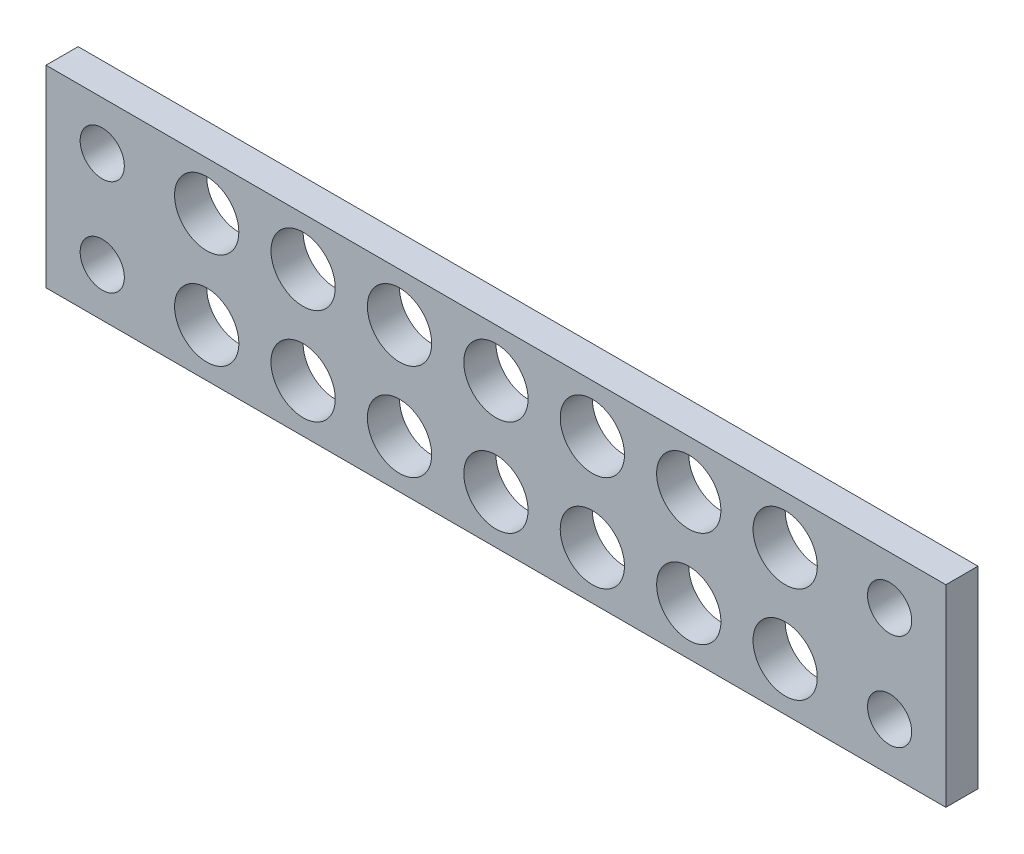
ISO-10303-21;
HEADER;
FILE_DESCRIPTION(('STEP AP214'),'2;1');
FILE_NAME('part.step','',(''),(''),'','','');
FILE_SCHEMA(('AUTOMOTIVE_DESIGN { 1 0 10303 214 1 1 1 1 }'));
ENDSEC;
DATA;
#1=APPLICATION_CONTEXT('core data for automotive mechanical design processes');
#2=APPLICATION_PROTOCOL_DEFINITION('international standard','automotive_design',2000,#1);
#3=PRODUCT_CONTEXT('',#1,'mechanical');
#4=PRODUCT('Part','Part','',(#3));
#5=PRODUCT_RELATED_PRODUCT_CATEGORY('part','',(#4));
#6=PRODUCT_DEFINITION_FORMATION('','',#4);
#7=PRODUCT_DEFINITION_CONTEXT('part definition',#1,'design');
#8=PRODUCT_DEFINITION('design','',#6,#7);
#9=PRODUCT_DEFINITION_SHAPE('','',#8);
#10=(LENGTH_UNIT() NAMED_UNIT(*) SI_UNIT(.MILLI.,.METRE.));
#11=(NAMED_UNIT(*) PLANE_ANGLE_UNIT() SI_UNIT($,.RADIAN.));
#12=(NAMED_UNIT(*) SI_UNIT($,.STERADIAN.) SOLID_ANGLE_UNIT());
#13=UNCERTAINTY_MEASURE_WITH_UNIT(LENGTH_MEASURE(1.E-05),#10,'distance_accuracy_value','');
#14=(GEOMETRIC_REPRESENTATION_CONTEXT(3) GLOBAL_UNCERTAINTY_ASSIGNED_CONTEXT((#13)) GLOBAL_UNIT_ASSIGNED_CONTEXT((#10,
#11,#12)) REPRESENTATION_CONTEXT('',''));
#15=CARTESIAN_POINT('',(0.,0.,0.));
#16=DIRECTION('',(0.,0.,1.));
#17=DIRECTION('',(1.,0.,0.));
#18=AXIS2_PLACEMENT_3D('',#15,#16,#17);
#19=CARTESIAN_POINT('',(0.,0.,2.));
#20=DIRECTION('',(0.,1.,0.));
#21=DIRECTION('',(0.,0.,1.));
#22=AXIS2_PLACEMENT_3D('',#19,#20,#21);
#23=PLANE('',#22);
#24=DIRECTION('',(1.,0.,0.));
#25=VECTOR('',#24,1.);
#26=CARTESIAN_POINT('',(0.,0.,0.));
#27=LINE('',#26,#25);
#28=CARTESIAN_POINT('',(-7.,0.,0.));
#29=VERTEX_POINT('',#28);
#30=CARTESIAN_POINT('',(49.,0.,0.));
#31=VERTEX_POINT('',#30);
#32=EDGE_CURVE('E73',#29,#31,#27,.T.);
#33=ORIENTED_EDGE('',*,*,#32,.T.);
#34=DIRECTION('',(0.,0.,1.));
#35=VECTOR('',#34,1.);
#36=CARTESIAN_POINT('',(49.,0.,-13.8924439894498));
#37=LINE('',#36,#35);
#38=CARTESIAN_POINT('',(49.,0.,2.));
#39=VERTEX_POINT('',#38);
#40=EDGE_CURVE('E76',#31,#39,#37,.T.);
#41=ORIENTED_EDGE('',*,*,#40,.T.);
#42=DIRECTION('',(1.,0.,0.));
#43=VECTOR('',#42,1.);
#44=CARTESIAN_POINT('',(0.,0.,2.));
#45=LINE('',#44,#43);
#46=CARTESIAN_POINT('',(-7.,0.,2.));
#47=VERTEX_POINT('',#46);
#48=EDGE_CURVE('E48',#47,#39,#45,.T.);
#49=ORIENTED_EDGE('',*,*,#48,.F.);
#50=DIRECTION('',(0.,0.,1.));
#51=VECTOR('',#50,1.);
#52=CARTESIAN_POINT('',(-7.,0.,-13.8924439894498));
#53=LINE('',#52,#51);
#54=EDGE_CURVE('E78',#29,#47,#53,.T.);
#55=ORIENTED_EDGE('',*,*,#54,.F.);
#56=EDGE_LOOP('',(#33,#41,#49,#55));
#57=FACE_BOUND('',#56,.T.);
#58=ADVANCED_FACE('F38',(#57),#23,.F.);
#59=CARTESIAN_POINT('',(0.,12.,2.));
#60=DIRECTION('',(0.,-1.,0.));
#61=DIRECTION('',(0.,0.,-1.));
#62=AXIS2_PLACEMENT_3D('',#59,#60,#61);
#63=PLANE('',#62);
#64=DIRECTION('',(-1.,0.,0.));
#65=VECTOR('',#64,1.);
#66=CARTESIAN_POINT('',(0.,12.,0.));
#67=LINE('',#66,#65);
#68=CARTESIAN_POINT('',(49.,12.,0.));
#69=VERTEX_POINT('',#68);
#70=CARTESIAN_POINT('',(-7.,12.,0.));
#71=VERTEX_POINT('',#70);
#72=EDGE_CURVE('E83',#69,#71,#67,.T.);
#73=ORIENTED_EDGE('',*,*,#72,.T.);
#74=DIRECTION('',(0.,0.,1.));
#75=VECTOR('',#74,1.);
#76=CARTESIAN_POINT('',(-7.,12.,-13.8924439894498));
#77=LINE('',#76,#75);
#78=CARTESIAN_POINT('',(-7.,12.,2.));
#79=VERTEX_POINT('',#78);
#80=EDGE_CURVE('E109',#71,#79,#77,.T.);
#81=ORIENTED_EDGE('',*,*,#80,.T.);
#82=DIRECTION('',(-1.,0.,0.));
#83=VECTOR('',#82,1.);
#84=CARTESIAN_POINT('',(0.,12.,2.));
#85=LINE('',#84,#83);
#86=CARTESIAN_POINT('',(49.,12.,2.));
#87=VERTEX_POINT('',#86);
#88=EDGE_CURVE('E11',#87,#79,#85,.T.);
#89=ORIENTED_EDGE('',*,*,#88,.F.);
#90=DIRECTION('',(0.,0.,1.));
#91=VECTOR('',#90,1.);
#92=CARTESIAN_POINT('',(49.,12.,-13.8924439894498));
#93=LINE('',#92,#91);
#94=EDGE_CURVE('E92',#69,#87,#93,.T.);
#95=ORIENTED_EDGE('',*,*,#94,.F.);
#96=EDGE_LOOP('',(#73,#81,#89,#95));
#97=FACE_BOUND('',#96,.T.);
#98=ADVANCED_FACE('F224',(#97),#63,.F.);
#99=CARTESIAN_POINT('',(0.,0.,2.));
#100=DIRECTION('',(0.,0.,-1.));
#101=DIRECTION('',(-1.,0.,0.));
#102=AXIS2_PLACEMENT_3D('',#99,#100,#101);
#103=PLANE('',#102);
#104=CARTESIAN_POINT('',(9.00000000000001,9.,2.));
#105=DIRECTION('',(0.,0.,1.));
#106=DIRECTION('',(1.,0.,0.));
#107=AXIS2_PLACEMENT_3D('',#104,#105,#106);
#108=CIRCLE('',#107,2.);
#109=CARTESIAN_POINT('',(11.,9.,2.));
#110=VERTEX_POINT('',#109);
#111=EDGE_CURVE('E529',#110,#110,#108,.T.);
#112=ORIENTED_EDGE('',*,*,#111,.F.);
#113=EDGE_LOOP('',(#112));
#114=FACE_BOUND('',#113,.T.);
#115=CARTESIAN_POINT('',(15.,9.,2.));
#116=DIRECTION('',(0.,0.,1.));
#117=DIRECTION('',(1.,0.,0.));
#118=AXIS2_PLACEMENT_3D('',#115,#116,#117);
#119=CIRCLE('',#118,2.);
#120=CARTESIAN_POINT('',(17.,9.,2.));
#121=VERTEX_POINT('',#120);
#122=EDGE_CURVE('E531',#121,#121,#119,.T.);
#123=ORIENTED_EDGE('',*,*,#122,.F.);
#124=EDGE_LOOP('',(#123));
#125=FACE_BOUND('',#124,.T.);
#126=CARTESIAN_POINT('',(21.,9.,2.));
#127=DIRECTION('',(0.,0.,1.));
#128=DIRECTION('',(1.,0.,0.));
#129=AXIS2_PLACEMENT_3D('',#126,#127,#128);
#130=CIRCLE('',#129,2.);
#131=CARTESIAN_POINT('',(23.,9.,2.));
#132=VERTEX_POINT('',#131);
#133=EDGE_CURVE('E538',#132,#132,#130,.T.);
#134=ORIENTED_EDGE('',*,*,#133,.F.);
#135=EDGE_LOOP('',(#134));
#136=FACE_BOUND('',#135,.T.);
#137=CARTESIAN_POINT('',(27.,9.,2.));
#138=DIRECTION('',(0.,0.,1.));
#139=DIRECTION('',(1.,0.,0.));
#140=AXIS2_PLACEMENT_3D('',#137,#138,#139);
#141=CIRCLE('',#140,2.);
#142=CARTESIAN_POINT('',(29.,9.,2.));
#143=VERTEX_POINT('',#142);
#144=EDGE_CURVE('E547',#143,#143,#141,.T.);
#145=ORIENTED_EDGE('',*,*,#144,.F.);
#146=EDGE_LOOP('',(#145));
#147=FACE_BOUND('',#146,.T.);
#148=CARTESIAN_POINT('',(33.,9.,2.));
#149=DIRECTION('',(0.,0.,1.));
#150=DIRECTION('',(1.,0.,0.));
#151=AXIS2_PLACEMENT_3D('',#148,#149,#150);
#152=CIRCLE('',#151,2.);
#153=CARTESIAN_POINT('',(35.,9.,2.));
#154=VERTEX_POINT('',#153);
#155=EDGE_CURVE('E551',#154,#154,#152,.T.);
#156=ORIENTED_EDGE('',*,*,#155,.F.);
#157=EDGE_LOOP('',(#156));
#158=FACE_BOUND('',#157,.T.);
#159=CARTESIAN_POINT('',(39.,9.,2.));
#160=DIRECTION('',(0.,0.,1.));
#161=DIRECTION('',(1.,0.,0.));
#162=AXIS2_PLACEMENT_3D('',#159,#160,#161);
#163=CIRCLE('',#162,2.);
#164=CARTESIAN_POINT('',(41.,9.,2.));
#165=VERTEX_POINT('',#164);
#166=EDGE_CURVE('E555',#165,#165,#163,.T.);
#167=ORIENTED_EDGE('',*,*,#166,.F.);
#168=EDGE_LOOP('',(#167));
#169=FACE_BOUND('',#168,.T.);
#170=CARTESIAN_POINT('',(39.,3.,2.));
#171=DIRECTION('',(0.,0.,1.));
#172=DIRECTION('',(-1.,0.,0.));
#173=AXIS2_PLACEMENT_3D('',#170,#171,#172);
#174=CIRCLE('',#173,2.);
#175=CARTESIAN_POINT('',(37.,3.,2.));
#176=VERTEX_POINT('',#175);
#177=EDGE_CURVE('E559',#176,#176,#174,.T.);
#178=ORIENTED_EDGE('',*,*,#177,.F.);
#179=EDGE_LOOP('',(#178));
#180=FACE_BOUND('',#179,.T.);
#181=CARTESIAN_POINT('',(33.,3.,2.));
#182=DIRECTION('',(0.,0.,1.));
#183=DIRECTION('',(-1.,0.,0.));
#184=AXIS2_PLACEMENT_3D('',#181,#182,#183);
#185=CIRCLE('',#184,2.);
#186=CARTESIAN_POINT('',(31.,3.,2.));
#187=VERTEX_POINT('',#186);
#188=EDGE_CURVE('E563',#187,#187,#185,.T.);
#189=ORIENTED_EDGE('',*,*,#188,.F.);
#190=EDGE_LOOP('',(#189));
#191=FACE_BOUND('',#190,.T.);
#192=CARTESIAN_POINT('',(27.,3.,2.));
#193=DIRECTION('',(0.,0.,1.));
#194=DIRECTION('',(-1.,0.,0.));
#195=AXIS2_PLACEMENT_3D('',#192,#193,#194);
#196=CIRCLE('',#195,2.);
#197=CARTESIAN_POINT('',(25.,3.,2.));
#198=VERTEX_POINT('',#197);
#199=EDGE_CURVE('E566',#198,#198,#196,.T.);
#200=ORIENTED_EDGE('',*,*,#199,.F.);
#201=EDGE_LOOP('',(#200));
#202=FACE_BOUND('',#201,.T.);
#203=CARTESIAN_POINT('',(21.,3.,2.));
#204=DIRECTION('',(0.,0.,1.));
#205=DIRECTION('',(-1.,0.,0.));
#206=AXIS2_PLACEMENT_3D('',#203,#204,#205);
#207=CIRCLE('',#206,2.);
#208=CARTESIAN_POINT('',(19.,3.,2.));
#209=VERTEX_POINT('',#208);
#210=EDGE_CURVE('E572',#209,#209,#207,.T.);
#211=ORIENTED_EDGE('',*,*,#210,.F.);
#212=EDGE_LOOP('',(#211));
#213=FACE_BOUND('',#212,.T.);
#214=CARTESIAN_POINT('',(15.,3.,2.));
#215=DIRECTION('',(0.,0.,1.));
#216=DIRECTION('',(-1.,0.,0.));
#217=AXIS2_PLACEMENT_3D('',#214,#215,#216);
#218=CIRCLE('',#217,2.);
#219=CARTESIAN_POINT('',(13.,3.,2.));
#220=VERTEX_POINT('',#219);
#221=EDGE_CURVE('E579',#220,#220,#218,.T.);
#222=ORIENTED_EDGE('',*,*,#221,.F.);
#223=EDGE_LOOP('',(#222));
#224=FACE_BOUND('',#223,.T.);
#225=CARTESIAN_POINT('',(9.00000000000001,3.,2.));
#226=DIRECTION('',(0.,0.,1.));
#227=DIRECTION('',(-1.,0.,0.));
#228=AXIS2_PLACEMENT_3D('',#225,#226,#227);
#229=CIRCLE('',#228,2.);
#230=CARTESIAN_POINT('',(7.,3.,2.));
#231=VERTEX_POINT('',#230);
#232=EDGE_CURVE('E584',#231,#231,#229,.T.);
#233=ORIENTED_EDGE('',*,*,#232,.F.);
#234=EDGE_LOOP('',(#233));
#235=FACE_BOUND('',#234,.T.);
#236=CARTESIAN_POINT('',(3.,3.,2.));
#237=DIRECTION('',(0.,0.,1.));
#238=DIRECTION('',(-1.,0.,0.));
#239=AXIS2_PLACEMENT_3D('',#236,#237,#238);
#240=CIRCLE('',#239,2.);
#241=CARTESIAN_POINT('',(1.,3.,2.));
#242=VERTEX_POINT('',#241);
#243=EDGE_CURVE('E541',#242,#242,#240,.T.);
#244=ORIENTED_EDGE('',*,*,#243,.F.);
#245=EDGE_LOOP('',(#244));
#246=FACE_BOUND('',#245,.T.);
#247=CARTESIAN_POINT('',(3.,9.,2.));
#248=DIRECTION('',(0.,0.,1.));
#249=DIRECTION('',(1.,0.,0.));
#250=AXIS2_PLACEMENT_3D('',#247,#248,#249);
#251=CIRCLE('',#250,2.);
#252=CARTESIAN_POINT('',(5.,9.,2.));
#253=VERTEX_POINT('',#252);
#254=EDGE_CURVE('E127',#253,#253,#251,.T.);
#255=ORIENTED_EDGE('',*,*,#254,.F.);
#256=EDGE_LOOP('',(#255));
#257=FACE_BOUND('',#256,.T.);
#258=CARTESIAN_POINT('',(45.5,9.,2.));
#259=DIRECTION('',(0.,0.,1.));
#260=DIRECTION('',(-1.,0.,0.));
#261=AXIS2_PLACEMENT_3D('',#258,#259,#260);
#262=CIRCLE('',#261,1.37499999999999);
#263=CARTESIAN_POINT('',(44.125,9.,2.));
#264=VERTEX_POINT('',#263);
#265=EDGE_CURVE('E200',#264,#264,#262,.T.);
#266=ORIENTED_EDGE('',*,*,#265,.F.);
#267=EDGE_LOOP('',(#266));
#268=FACE_BOUND('',#267,.T.);
#269=CARTESIAN_POINT('',(-3.5,3.,2.));
#270=DIRECTION('',(0.,0.,1.));
#271=DIRECTION('',(-1.,0.,0.));
#272=AXIS2_PLACEMENT_3D('',#269,#270,#271);
#273=CIRCLE('',#272,1.375);
#274=CARTESIAN_POINT('',(-4.875,3.,2.));
#275=VERTEX_POINT('',#274);
#276=EDGE_CURVE('E191',#275,#275,#273,.T.);
#277=ORIENTED_EDGE('',*,*,#276,.F.);
#278=EDGE_LOOP('',(#277));
#279=FACE_BOUND('',#278,.T.);
#280=CARTESIAN_POINT('',(45.5,3.,2.));
#281=DIRECTION('',(0.,0.,1.));
#282=DIRECTION('',(1.,0.,0.));
#283=AXIS2_PLACEMENT_3D('',#280,#281,#282);
#284=CIRCLE('',#283,1.37499999999999);
#285=CARTESIAN_POINT('',(46.875,3.,2.));
#286=VERTEX_POINT('',#285);
#287=EDGE_CURVE('E178',#286,#286,#284,.T.);
#288=ORIENTED_EDGE('',*,*,#287,.F.);
#289=EDGE_LOOP('',(#288));
#290=FACE_BOUND('',#289,.T.);
#291=CARTESIAN_POINT('',(-3.5,9.,2.));
#292=DIRECTION('',(0.,0.,1.));
#293=DIRECTION('',(1.,0.,0.));
#294=AXIS2_PLACEMENT_3D('',#291,#292,#293);
#295=CIRCLE('',#294,1.375);
#296=CARTESIAN_POINT('',(-2.125,9.,2.));
#297=VERTEX_POINT('',#296);
#298=EDGE_CURVE('E199',#297,#297,#295,.T.);
#299=ORIENTED_EDGE('',*,*,#298,.F.);
#300=EDGE_LOOP('',(#299));
#301=FACE_BOUND('',#300,.T.);
#302=ORIENTED_EDGE('',*,*,#88,.T.);
#303=DIRECTION('',(0.,-1.,0.));
#304=VECTOR('',#303,1.);
#305=CARTESIAN_POINT('',(-7.,12.,2.));
#306=LINE('',#305,#304);
#307=EDGE_CURVE('E105',#79,#47,#306,.T.);
#308=ORIENTED_EDGE('',*,*,#307,.T.);
#309=ORIENTED_EDGE('',*,*,#48,.T.);
#310=DIRECTION('',(0.,1.,0.));
#311=VECTOR('',#310,1.);
#312=CARTESIAN_POINT('',(49.,12.,2.));
#313=LINE('',#312,#311);
#314=EDGE_CURVE('E96',#39,#87,#313,.T.);
#315=ORIENTED_EDGE('',*,*,#314,.T.);
#316=EDGE_LOOP('',(#302,#308,#309,#315));
#317=FACE_BOUND('',#316,.T.);
#318=ADVANCED_FACE('F221',(#114,#125,#136,#147,#158,#169,#180,#191,#202,#213,#224,#235,#246,
#257,#268,#279,#290,#301,#317),#103,.F.);
#319=CARTESIAN_POINT('',(0.,0.,0.));
#320=DIRECTION('',(0.,0.,-1.));
#321=DIRECTION('',(-1.,0.,0.));
#322=AXIS2_PLACEMENT_3D('',#319,#320,#321);
#323=PLANE('',#322);
#324=CARTESIAN_POINT('',(9.00000000000001,9.,0.));
#325=DIRECTION('',(0.,0.,-1.));
#326=DIRECTION('',(-1.,0.,0.));
#327=AXIS2_PLACEMENT_3D('',#324,#325,#326);
#328=CIRCLE('',#327,2.);
#329=CARTESIAN_POINT('',(7.,9.,0.));
#330=VERTEX_POINT('',#329);
#331=EDGE_CURVE('E41',#330,#330,#328,.T.);
#332=ORIENTED_EDGE('',*,*,#331,.F.);
#333=EDGE_LOOP('',(#332));
#334=FACE_BOUND('',#333,.T.);
#335=CARTESIAN_POINT('',(15.,9.,0.));
#336=DIRECTION('',(0.,0.,-1.));
#337=DIRECTION('',(-1.,0.,0.));
#338=AXIS2_PLACEMENT_3D('',#335,#336,#337);
#339=CIRCLE('',#338,2.);
#340=CARTESIAN_POINT('',(13.,9.,0.));
#341=VERTEX_POINT('',#340);
#342=EDGE_CURVE('E170',#341,#341,#339,.T.);
#343=ORIENTED_EDGE('',*,*,#342,.F.);
#344=EDGE_LOOP('',(#343));
#345=FACE_BOUND('',#344,.T.);
#346=CARTESIAN_POINT('',(21.,9.,0.));
#347=DIRECTION('',(0.,0.,-1.));
#348=DIRECTION('',(-1.,0.,0.));
#349=AXIS2_PLACEMENT_3D('',#346,#347,#348);
#350=CIRCLE('',#349,2.);
#351=CARTESIAN_POINT('',(19.,9.,0.));
#352=VERTEX_POINT('',#351);
#353=EDGE_CURVE('E167',#352,#352,#350,.T.);
#354=ORIENTED_EDGE('',*,*,#353,.F.);
#355=EDGE_LOOP('',(#354));
#356=FACE_BOUND('',#355,.T.);
#357=CARTESIAN_POINT('',(27.,9.,0.));
#358=DIRECTION('',(0.,0.,-1.));
#359=DIRECTION('',(-1.,0.,0.));
#360=AXIS2_PLACEMENT_3D('',#357,#358,#359);
#361=CIRCLE('',#360,2.);
#362=CARTESIAN_POINT('',(25.,9.,0.));
#363=VERTEX_POINT('',#362);
#364=EDGE_CURVE('E163',#363,#363,#361,.T.);
#365=ORIENTED_EDGE('',*,*,#364,.F.);
#366=EDGE_LOOP('',(#365));
#367=FACE_BOUND('',#366,.T.);
#368=CARTESIAN_POINT('',(33.,9.,0.));
#369=DIRECTION('',(0.,0.,-1.));
#370=DIRECTION('',(-1.,0.,0.));
#371=AXIS2_PLACEMENT_3D('',#368,#369,#370);
#372=CIRCLE('',#371,2.);
#373=CARTESIAN_POINT('',(31.,9.,0.));
#374=VERTEX_POINT('',#373);
#375=EDGE_CURVE('E159',#374,#374,#372,.T.);
#376=ORIENTED_EDGE('',*,*,#375,.F.);
#377=EDGE_LOOP('',(#376));
#378=FACE_BOUND('',#377,.T.);
#379=CARTESIAN_POINT('',(39.,9.,0.));
#380=DIRECTION('',(0.,0.,-1.));
#381=DIRECTION('',(-1.,0.,0.));
#382=AXIS2_PLACEMENT_3D('',#379,#380,#381);
#383=CIRCLE('',#382,2.);
#384=CARTESIAN_POINT('',(37.,9.,0.));
#385=VERTEX_POINT('',#384);
#386=EDGE_CURVE('E155',#385,#385,#383,.T.);
#387=ORIENTED_EDGE('',*,*,#386,.F.);
#388=EDGE_LOOP('',(#387));
#389=FACE_BOUND('',#388,.T.);
#390=CARTESIAN_POINT('',(39.,3.,0.));
#391=DIRECTION('',(0.,0.,-1.));
#392=DIRECTION('',(-1.,0.,0.));
#393=AXIS2_PLACEMENT_3D('',#390,#391,#392);
#394=CIRCLE('',#393,2.);
#395=CARTESIAN_POINT('',(37.,3.,0.));
#396=VERTEX_POINT('',#395);
#397=EDGE_CURVE('E151',#396,#396,#394,.T.);
#398=ORIENTED_EDGE('',*,*,#397,.F.);
#399=EDGE_LOOP('',(#398));
#400=FACE_BOUND('',#399,.T.);
#401=CARTESIAN_POINT('',(33.,3.,0.));
#402=DIRECTION('',(0.,0.,-1.));
#403=DIRECTION('',(-1.,0.,0.));
#404=AXIS2_PLACEMENT_3D('',#401,#402,#403);
#405=CIRCLE('',#404,2.);
#406=CARTESIAN_POINT('',(31.,3.,0.));
#407=VERTEX_POINT('',#406);
#408=EDGE_CURVE('E147',#407,#407,#405,.T.);
#409=ORIENTED_EDGE('',*,*,#408,.F.);
#410=EDGE_LOOP('',(#409));
#411=FACE_BOUND('',#410,.T.);
#412=CARTESIAN_POINT('',(27.,3.,0.));
#413=DIRECTION('',(0.,0.,-1.));
#414=DIRECTION('',(-1.,0.,0.));
#415=AXIS2_PLACEMENT_3D('',#412,#413,#414);
#416=CIRCLE('',#415,2.);
#417=CARTESIAN_POINT('',(25.,3.,0.));
#418=VERTEX_POINT('',#417);
#419=EDGE_CURVE('E143',#418,#418,#416,.T.);
#420=ORIENTED_EDGE('',*,*,#419,.F.);
#421=EDGE_LOOP('',(#420));
#422=FACE_BOUND('',#421,.T.);
#423=CARTESIAN_POINT('',(21.,3.,0.));
#424=DIRECTION('',(0.,0.,-1.));
#425=DIRECTION('',(-1.,0.,0.));
#426=AXIS2_PLACEMENT_3D('',#423,#424,#425);
#427=CIRCLE('',#426,2.);
#428=CARTESIAN_POINT('',(19.,3.,0.));
#429=VERTEX_POINT('',#428);
#430=EDGE_CURVE('E139',#429,#429,#427,.T.);
#431=ORIENTED_EDGE('',*,*,#430,.F.);
#432=EDGE_LOOP('',(#431));
#433=FACE_BOUND('',#432,.T.);
#434=CARTESIAN_POINT('',(15.,3.,0.));
#435=DIRECTION('',(0.,0.,-1.));
#436=DIRECTION('',(-1.,0.,0.));
#437=AXIS2_PLACEMENT_3D('',#434,#435,#436);
#438=CIRCLE('',#437,2.);
#439=CARTESIAN_POINT('',(13.,3.,0.));
#440=VERTEX_POINT('',#439);
#441=EDGE_CURVE('E135',#440,#440,#438,.T.);
#442=ORIENTED_EDGE('',*,*,#441,.F.);
#443=EDGE_LOOP('',(#442));
#444=FACE_BOUND('',#443,.T.);
#445=CARTESIAN_POINT('',(9.00000000000001,3.,0.));
#446=DIRECTION('',(0.,0.,-1.));
#447=DIRECTION('',(-1.,0.,0.));
#448=AXIS2_PLACEMENT_3D('',#445,#446,#447);
#449=CIRCLE('',#448,2.);
#450=CARTESIAN_POINT('',(7.,3.,0.));
#451=VERTEX_POINT('',#450);
#452=EDGE_CURVE('E131',#451,#451,#449,.T.);
#453=ORIENTED_EDGE('',*,*,#452,.F.);
#454=EDGE_LOOP('',(#453));
#455=FACE_BOUND('',#454,.T.);
#456=CARTESIAN_POINT('',(3.,3.,0.));
#457=DIRECTION('',(0.,0.,-1.));
#458=DIRECTION('',(-1.,0.,0.));
#459=AXIS2_PLACEMENT_3D('',#456,#457,#458);
#460=CIRCLE('',#459,2.);
#461=CARTESIAN_POINT('',(1.,3.,0.));
#462=VERTEX_POINT('',#461);
#463=EDGE_CURVE('E126',#462,#462,#460,.T.);
#464=ORIENTED_EDGE('',*,*,#463,.F.);
#465=EDGE_LOOP('',(#464));
#466=FACE_BOUND('',#465,.T.);
#467=CARTESIAN_POINT('',(3.,9.,0.));
#468=DIRECTION('',(0.,0.,-1.));
#469=DIRECTION('',(-1.,0.,0.));
#470=AXIS2_PLACEMENT_3D('',#467,#468,#469);
#471=CIRCLE('',#470,2.);
#472=CARTESIAN_POINT('',(1.,9.,0.));
#473=VERTEX_POINT('',#472);
#474=EDGE_CURVE('E122',#473,#473,#471,.T.);
#475=ORIENTED_EDGE('',*,*,#474,.F.);
#476=EDGE_LOOP('',(#475));
#477=FACE_BOUND('',#476,.T.);
#478=CARTESIAN_POINT('',(45.5,9.,0.));
#479=DIRECTION('',(0.,0.,1.));
#480=DIRECTION('',(-1.,0.,0.));
#481=AXIS2_PLACEMENT_3D('',#478,#479,#480);
#482=CIRCLE('',#481,1.37499999999999);
#483=CARTESIAN_POINT('',(44.125,9.,0.));
#484=VERTEX_POINT('',#483);
#485=EDGE_CURVE('E195',#484,#484,#482,.T.);
#486=ORIENTED_EDGE('',*,*,#485,.T.);
#487=EDGE_LOOP('',(#486));
#488=FACE_BOUND('',#487,.T.);
#489=CARTESIAN_POINT('',(-3.5,3.,0.));
#490=DIRECTION('',(0.,0.,1.));
#491=DIRECTION('',(-1.,0.,0.));
#492=AXIS2_PLACEMENT_3D('',#489,#490,#491);
#493=CIRCLE('',#492,1.375);
#494=CARTESIAN_POINT('',(-4.875,3.,0.));
#495=VERTEX_POINT('',#494);
#496=EDGE_CURVE('E204',#495,#495,#493,.T.);
#497=ORIENTED_EDGE('',*,*,#496,.T.);
#498=EDGE_LOOP('',(#497));
#499=FACE_BOUND('',#498,.T.);
#500=CARTESIAN_POINT('',(45.5,3.,0.));
#501=DIRECTION('',(0.,0.,1.));
#502=DIRECTION('',(1.,0.,0.));
#503=AXIS2_PLACEMENT_3D('',#500,#501,#502);
#504=CIRCLE('',#503,1.37499999999999);
#505=CARTESIAN_POINT('',(46.875,3.,0.));
#506=VERTEX_POINT('',#505);
#507=EDGE_CURVE('E184',#506,#506,#504,.T.);
#508=ORIENTED_EDGE('',*,*,#507,.T.);
#509=EDGE_LOOP('',(#508));
#510=FACE_BOUND('',#509,.T.);
#511=CARTESIAN_POINT('',(-3.5,9.,0.));
#512=DIRECTION('',(0.,0.,1.));
#513=DIRECTION('',(1.,0.,0.));
#514=AXIS2_PLACEMENT_3D('',#511,#512,#513);
#515=CIRCLE('',#514,1.375);
#516=CARTESIAN_POINT('',(-2.125,9.,0.));
#517=VERTEX_POINT('',#516);
#518=EDGE_CURVE('E101',#517,#517,#515,.T.);
#519=ORIENTED_EDGE('',*,*,#518,.T.);
#520=EDGE_LOOP('',(#519));
#521=FACE_BOUND('',#520,.T.);
#522=ORIENTED_EDGE('',*,*,#32,.F.);
#523=DIRECTION('',(0.,-1.,0.));
#524=VECTOR('',#523,1.);
#525=CARTESIAN_POINT('',(-7.,12.,0.));
#526=LINE('',#525,#524);
#527=EDGE_CURVE('E110',#71,#29,#526,.T.);
#528=ORIENTED_EDGE('',*,*,#527,.F.);
#529=ORIENTED_EDGE('',*,*,#72,.F.);
#530=DIRECTION('',(0.,1.,0.));
#531=VECTOR('',#530,1.);
#532=CARTESIAN_POINT('',(49.,12.,0.));
#533=LINE('',#532,#531);
#534=EDGE_CURVE('E86',#31,#69,#533,.T.);
#535=ORIENTED_EDGE('',*,*,#534,.F.);
#536=EDGE_LOOP('',(#522,#528,#529,#535));
#537=FACE_BOUND('',#536,.T.);
#538=ADVANCED_FACE('F87',(#334,#345,#356,#367,#378,#389,#400,#411,#422,#433,#444,#455,#466,#477,
#488,#499,#510,#521,#537),#323,.T.);
#539=CARTESIAN_POINT('',(-7.,12.,-13.8924439894498));
#540=DIRECTION('',(-1.,0.,0.));
#541=DIRECTION('',(0.,-1.,0.));
#542=AXIS2_PLACEMENT_3D('',#539,#540,#541);
#543=PLANE('',#542);
#544=ORIENTED_EDGE('',*,*,#80,.F.);
#545=ORIENTED_EDGE('',*,*,#527,.T.);
#546=ORIENTED_EDGE('',*,*,#54,.T.);
#547=ORIENTED_EDGE('',*,*,#307,.F.);
#548=EDGE_LOOP('',(#544,#545,#546,#547));
#549=FACE_BOUND('',#548,.T.);
#550=ADVANCED_FACE('F231',(#549),#543,.T.);
#551=CARTESIAN_POINT('',(49.,12.,-13.8924439894498));
#552=DIRECTION('',(1.,0.,0.));
#553=DIRECTION('',(0.,1.,0.));
#554=AXIS2_PLACEMENT_3D('',#551,#552,#553);
#555=PLANE('',#554);
#556=ORIENTED_EDGE('',*,*,#40,.F.);
#557=ORIENTED_EDGE('',*,*,#534,.T.);
#558=ORIENTED_EDGE('',*,*,#94,.T.);
#559=ORIENTED_EDGE('',*,*,#314,.F.);
#560=EDGE_LOOP('',(#556,#557,#558,#559));
#561=FACE_BOUND('',#560,.T.);
#562=ADVANCED_FACE('F94',(#561),#555,.T.);
#563=CARTESIAN_POINT('',(-3.5,9.,0.));
#564=DIRECTION('',(0.,0.,1.));
#565=DIRECTION('',(1.,0.,0.));
#566=AXIS2_PLACEMENT_3D('',#563,#564,#565);
#567=CYLINDRICAL_SURFACE('',#566,1.375);
#568=ORIENTED_EDGE('',*,*,#518,.F.);
#569=EDGE_LOOP('',(#568));
#570=FACE_BOUND('',#569,.T.);
#571=ORIENTED_EDGE('',*,*,#298,.T.);
#572=EDGE_LOOP('',(#571));
#573=FACE_BOUND('',#572,.T.);
#574=ADVANCED_FACE('F219',(#570,#573),#567,.F.);
#575=CARTESIAN_POINT('',(45.5,3.,0.));
#576=DIRECTION('',(0.,0.,1.));
#577=DIRECTION('',(1.,0.,0.));
#578=AXIS2_PLACEMENT_3D('',#575,#576,#577);
#579=CYLINDRICAL_SURFACE('',#578,1.37499999999999);
#580=ORIENTED_EDGE('',*,*,#507,.F.);
#581=EDGE_LOOP('',(#580));
#582=FACE_BOUND('',#581,.T.);
#583=ORIENTED_EDGE('',*,*,#287,.T.);
#584=EDGE_LOOP('',(#583));
#585=FACE_BOUND('',#584,.T.);
#586=ADVANCED_FACE('F275',(#582,#585),#579,.F.);
#587=CARTESIAN_POINT('',(-3.5,3.,0.));
#588=DIRECTION('',(0.,0.,1.));
#589=DIRECTION('',(1.,0.,0.));
#590=AXIS2_PLACEMENT_3D('',#587,#588,#589);
#591=CYLINDRICAL_SURFACE('',#590,1.375);
#592=ORIENTED_EDGE('',*,*,#496,.F.);
#593=EDGE_LOOP('',(#592));
#594=FACE_BOUND('',#593,.T.);
#595=ORIENTED_EDGE('',*,*,#276,.T.);
#596=EDGE_LOOP('',(#595));
#597=FACE_BOUND('',#596,.T.);
#598=ADVANCED_FACE('F285',(#594,#597),#591,.F.);
#599=CARTESIAN_POINT('',(45.5,9.,0.));
#600=DIRECTION('',(0.,0.,1.));
#601=DIRECTION('',(1.,0.,0.));
#602=AXIS2_PLACEMENT_3D('',#599,#600,#601);
#603=CYLINDRICAL_SURFACE('',#602,1.37499999999999);
#604=ORIENTED_EDGE('',*,*,#485,.F.);
#605=EDGE_LOOP('',(#604));
#606=FACE_BOUND('',#605,.T.);
#607=ORIENTED_EDGE('',*,*,#265,.T.);
#608=EDGE_LOOP('',(#607));
#609=FACE_BOUND('',#608,.T.);
#610=ADVANCED_FACE('F295',(#606,#609),#603,.F.);
#611=CARTESIAN_POINT('',(3.,9.,-8.));
#612=DIRECTION('',(0.,0.,1.));
#613=DIRECTION('',(1.,0.,0.));
#614=AXIS2_PLACEMENT_3D('',#611,#612,#613);
#615=CYLINDRICAL_SURFACE('',#614,2.);
#616=ORIENTED_EDGE('',*,*,#474,.T.);
#617=EDGE_LOOP('',(#616));
#618=FACE_BOUND('',#617,.T.);
#619=ORIENTED_EDGE('',*,*,#254,.T.);
#620=EDGE_LOOP('',(#619));
#621=FACE_BOUND('',#620,.T.);
#622=ADVANCED_FACE('F305',(#618,#621),#615,.F.);
#623=CARTESIAN_POINT('',(3.,3.,-8.));
#624=DIRECTION('',(0.,0.,1.));
#625=DIRECTION('',(1.,0.,0.));
#626=AXIS2_PLACEMENT_3D('',#623,#624,#625);
#627=CYLINDRICAL_SURFACE('',#626,2.);
#628=ORIENTED_EDGE('',*,*,#463,.T.);
#629=EDGE_LOOP('',(#628));
#630=FACE_BOUND('',#629,.T.);
#631=ORIENTED_EDGE('',*,*,#243,.T.);
#632=EDGE_LOOP('',(#631));
#633=FACE_BOUND('',#632,.T.);
#634=ADVANCED_FACE('F314',(#630,#633),#627,.F.);
#635=CARTESIAN_POINT('',(9.00000000000001,3.,-8.));
#636=DIRECTION('',(0.,0.,1.));
#637=DIRECTION('',(1.,0.,0.));
#638=AXIS2_PLACEMENT_3D('',#635,#636,#637);
#639=CYLINDRICAL_SURFACE('',#638,2.);
#640=ORIENTED_EDGE('',*,*,#452,.T.);
#641=EDGE_LOOP('',(#640));
#642=FACE_BOUND('',#641,.T.);
#643=ORIENTED_EDGE('',*,*,#232,.T.);
#644=EDGE_LOOP('',(#643));
#645=FACE_BOUND('',#644,.T.);
#646=ADVANCED_FACE('F324',(#642,#645),#639,.F.);
#647=CARTESIAN_POINT('',(15.,3.,-8.));
#648=DIRECTION('',(0.,0.,1.));
#649=DIRECTION('',(1.,0.,0.));
#650=AXIS2_PLACEMENT_3D('',#647,#648,#649);
#651=CYLINDRICAL_SURFACE('',#650,2.);
#652=ORIENTED_EDGE('',*,*,#441,.T.);
#653=EDGE_LOOP('',(#652));
#654=FACE_BOUND('',#653,.T.);
#655=ORIENTED_EDGE('',*,*,#221,.T.);
#656=EDGE_LOOP('',(#655));
#657=FACE_BOUND('',#656,.T.);
#658=ADVANCED_FACE('F334',(#654,#657),#651,.F.);
#659=CARTESIAN_POINT('',(21.,3.,-8.));
#660=DIRECTION('',(0.,0.,1.));
#661=DIRECTION('',(1.,0.,0.));
#662=AXIS2_PLACEMENT_3D('',#659,#660,#661);
#663=CYLINDRICAL_SURFACE('',#662,2.);
#664=ORIENTED_EDGE('',*,*,#430,.T.);
#665=EDGE_LOOP('',(#664));
#666=FACE_BOUND('',#665,.T.);
#667=ORIENTED_EDGE('',*,*,#210,.T.);
#668=EDGE_LOOP('',(#667));
#669=FACE_BOUND('',#668,.T.);
#670=ADVANCED_FACE('F344',(#666,#669),#663,.F.);
#671=CARTESIAN_POINT('',(27.,3.,-8.));
#672=DIRECTION('',(0.,0.,1.));
#673=DIRECTION('',(1.,0.,0.));
#674=AXIS2_PLACEMENT_3D('',#671,#672,#673);
#675=CYLINDRICAL_SURFACE('',#674,2.);
#676=ORIENTED_EDGE('',*,*,#419,.T.);
#677=EDGE_LOOP('',(#676));
#678=FACE_BOUND('',#677,.T.);
#679=ORIENTED_EDGE('',*,*,#199,.T.);
#680=EDGE_LOOP('',(#679));
#681=FACE_BOUND('',#680,.T.);
#682=ADVANCED_FACE('F354',(#678,#681),#675,.F.);
#683=CARTESIAN_POINT('',(33.,3.,-8.));
#684=DIRECTION('',(0.,0.,1.));
#685=DIRECTION('',(1.,0.,0.));
#686=AXIS2_PLACEMENT_3D('',#683,#684,#685);
#687=CYLINDRICAL_SURFACE('',#686,2.);
#688=ORIENTED_EDGE('',*,*,#408,.T.);
#689=EDGE_LOOP('',(#688));
#690=FACE_BOUND('',#689,.T.);
#691=ORIENTED_EDGE('',*,*,#188,.T.);
#692=EDGE_LOOP('',(#691));
#693=FACE_BOUND('',#692,.T.);
#694=ADVANCED_FACE('F364',(#690,#693),#687,.F.);
#695=CARTESIAN_POINT('',(39.,3.,-8.));
#696=DIRECTION('',(0.,0.,1.));
#697=DIRECTION('',(1.,0.,0.));
#698=AXIS2_PLACEMENT_3D('',#695,#696,#697);
#699=CYLINDRICAL_SURFACE('',#698,2.);
#700=ORIENTED_EDGE('',*,*,#397,.T.);
#701=EDGE_LOOP('',(#700));
#702=FACE_BOUND('',#701,.T.);
#703=ORIENTED_EDGE('',*,*,#177,.T.);
#704=EDGE_LOOP('',(#703));
#705=FACE_BOUND('',#704,.T.);
#706=ADVANCED_FACE('F374',(#702,#705),#699,.F.);
#707=CARTESIAN_POINT('',(39.,9.,-8.));
#708=DIRECTION('',(0.,0.,1.));
#709=DIRECTION('',(1.,0.,0.));
#710=AXIS2_PLACEMENT_3D('',#707,#708,#709);
#711=CYLINDRICAL_SURFACE('',#710,2.);
#712=ORIENTED_EDGE('',*,*,#386,.T.);
#713=EDGE_LOOP('',(#712));
#714=FACE_BOUND('',#713,.T.);
#715=ORIENTED_EDGE('',*,*,#166,.T.);
#716=EDGE_LOOP('',(#715));
#717=FACE_BOUND('',#716,.T.);
#718=ADVANCED_FACE('F384',(#714,#717),#711,.F.);
#719=CARTESIAN_POINT('',(33.,9.,-8.));
#720=DIRECTION('',(0.,0.,1.));
#721=DIRECTION('',(1.,0.,0.));
#722=AXIS2_PLACEMENT_3D('',#719,#720,#721);
#723=CYLINDRICAL_SURFACE('',#722,2.);
#724=ORIENTED_EDGE('',*,*,#375,.T.);
#725=EDGE_LOOP('',(#724));
#726=FACE_BOUND('',#725,.T.);
#727=ORIENTED_EDGE('',*,*,#155,.T.);
#728=EDGE_LOOP('',(#727));
#729=FACE_BOUND('',#728,.T.);
#730=ADVANCED_FACE('F394',(#726,#729),#723,.F.);
#731=CARTESIAN_POINT('',(27.,9.,-8.));
#732=DIRECTION('',(0.,0.,1.));
#733=DIRECTION('',(1.,0.,0.));
#734=AXIS2_PLACEMENT_3D('',#731,#732,#733);
#735=CYLINDRICAL_SURFACE('',#734,2.);
#736=ORIENTED_EDGE('',*,*,#364,.T.);
#737=EDGE_LOOP('',(#736));
#738=FACE_BOUND('',#737,.T.);
#739=ORIENTED_EDGE('',*,*,#144,.T.);
#740=EDGE_LOOP('',(#739));
#741=FACE_BOUND('',#740,.T.);
#742=ADVANCED_FACE('F404',(#738,#741),#735,.F.);
#743=CARTESIAN_POINT('',(21.,9.,-8.));
#744=DIRECTION('',(0.,0.,1.));
#745=DIRECTION('',(1.,0.,0.));
#746=AXIS2_PLACEMENT_3D('',#743,#744,#745);
#747=CYLINDRICAL_SURFACE('',#746,2.);
#748=ORIENTED_EDGE('',*,*,#353,.T.);
#749=EDGE_LOOP('',(#748));
#750=FACE_BOUND('',#749,.T.);
#751=ORIENTED_EDGE('',*,*,#133,.T.);
#752=EDGE_LOOP('',(#751));
#753=FACE_BOUND('',#752,.T.);
#754=ADVANCED_FACE('F414',(#750,#753),#747,.F.);
#755=CARTESIAN_POINT('',(15.,9.,-8.));
#756=DIRECTION('',(0.,0.,1.));
#757=DIRECTION('',(1.,0.,0.));
#758=AXIS2_PLACEMENT_3D('',#755,#756,#757);
#759=CYLINDRICAL_SURFACE('',#758,2.);
#760=ORIENTED_EDGE('',*,*,#342,.T.);
#761=EDGE_LOOP('',(#760));
#762=FACE_BOUND('',#761,.T.);
#763=ORIENTED_EDGE('',*,*,#122,.T.);
#764=EDGE_LOOP('',(#763));
#765=FACE_BOUND('',#764,.T.);
#766=ADVANCED_FACE('F424',(#762,#765),#759,.F.);
#767=CARTESIAN_POINT('',(9.00000000000001,9.,-8.));
#768=DIRECTION('',(0.,0.,1.));
#769=DIRECTION('',(1.,0.,0.));
#770=AXIS2_PLACEMENT_3D('',#767,#768,#769);
#771=CYLINDRICAL_SURFACE('',#770,2.);
#772=ORIENTED_EDGE('',*,*,#331,.T.);
#773=EDGE_LOOP('',(#772));
#774=FACE_BOUND('',#773,.T.);
#775=ORIENTED_EDGE('',*,*,#111,.T.);
#776=EDGE_LOOP('',(#775));
#777=FACE_BOUND('',#776,.T.);
#778=ADVANCED_FACE('F434',(#774,#777),#771,.F.);
#779=CLOSED_SHELL('',(#58,#98,#318,#538,#550,#562,#574,#586,#598,#610,#622,#634,#646,#658,#670,
#682,#694,#706,#718,#730,#742,#754,#766,#778));
#780=MANIFOLD_SOLID_BREP('B2',#779);
#781=ADVANCED_BREP_SHAPE_REPRESENTATION('',(#18,#780),#14);
#782=SHAPE_DEFINITION_REPRESENTATION(#9,#781);
ENDSEC;
END-ISO-10303-21;
